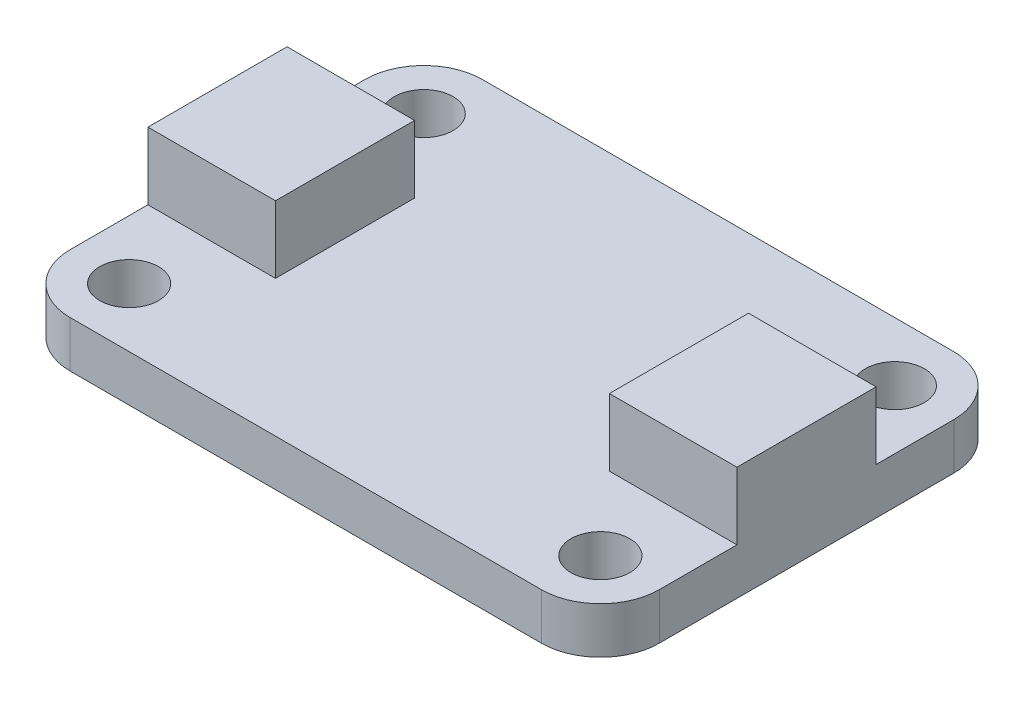
ISO-10303-21;
HEADER;
FILE_DESCRIPTION(('STEP AP214'),'2;1');
FILE_NAME('part.step','',(''),(''),'','','');
FILE_SCHEMA(('AUTOMOTIVE_DESIGN { 1 0 10303 214 1 1 1 1 }'));
ENDSEC;
DATA;
#1=APPLICATION_CONTEXT('core data for automotive mechanical design processes');
#2=APPLICATION_PROTOCOL_DEFINITION('international standard','automotive_design',2000,#1);
#3=PRODUCT_CONTEXT('',#1,'mechanical');
#4=PRODUCT('Part','Part','',(#3));
#5=PRODUCT_RELATED_PRODUCT_CATEGORY('part','',(#4));
#6=PRODUCT_DEFINITION_FORMATION('','',#4);
#7=PRODUCT_DEFINITION_CONTEXT('part definition',#1,'design');
#8=PRODUCT_DEFINITION('design','',#6,#7);
#9=PRODUCT_DEFINITION_SHAPE('','',#8);
#10=(LENGTH_UNIT() NAMED_UNIT(*) SI_UNIT(.MILLI.,.METRE.));
#11=(NAMED_UNIT(*) PLANE_ANGLE_UNIT() SI_UNIT($,.RADIAN.));
#12=(NAMED_UNIT(*) SI_UNIT($,.STERADIAN.) SOLID_ANGLE_UNIT());
#13=UNCERTAINTY_MEASURE_WITH_UNIT(LENGTH_MEASURE(1.E-05),#10,'distance_accuracy_value','');
#14=(GEOMETRIC_REPRESENTATION_CONTEXT(3) GLOBAL_UNCERTAINTY_ASSIGNED_CONTEXT((#13)) GLOBAL_UNIT_ASSIGNED_CONTEXT((#10,
#11,#12)) REPRESENTATION_CONTEXT('',''));
#15=CARTESIAN_POINT('',(0.,0.,0.));
#16=DIRECTION('',(0.,0.,1.));
#17=DIRECTION('',(1.,0.,0.));
#18=AXIS2_PLACEMENT_3D('',#15,#16,#17);
#19=CARTESIAN_POINT('',(0.,2.,0.));
#20=DIRECTION('',(0.,-1.,0.));
#21=DIRECTION('',(0.,0.,-1.));
#22=AXIS2_PLACEMENT_3D('',#19,#20,#21);
#23=PLANE('',#22);
#24=CARTESIAN_POINT('',(2.54,2.,-2.54));
#25=DIRECTION('',(0.,1.,0.));
#26=DIRECTION('',(0.,0.,-1.));
#27=AXIS2_PLACEMENT_3D('',#24,#25,#26);
#28=CIRCLE('',#27,1.27);
#29=CARTESIAN_POINT('',(2.54,2.,-3.81000000000001));
#30=VERTEX_POINT('',#29);
#31=EDGE_CURVE('E231',#30,#30,#28,.T.);
#32=ORIENTED_EDGE('',*,*,#31,.F.);
#33=EDGE_LOOP('',(#32));
#34=FACE_BOUND('',#33,.T.);
#35=CARTESIAN_POINT('',(22.86,2.,-2.54));
#36=DIRECTION('',(0.,1.,0.));
#37=DIRECTION('',(0.,0.,1.));
#38=AXIS2_PLACEMENT_3D('',#35,#36,#37);
#39=CIRCLE('',#38,1.27);
#40=CARTESIAN_POINT('',(22.86,2.,-1.27));
#41=VERTEX_POINT('',#40);
#42=EDGE_CURVE('E245',#41,#41,#39,.T.);
#43=ORIENTED_EDGE('',*,*,#42,.F.);
#44=EDGE_LOOP('',(#43));
#45=FACE_BOUND('',#44,.T.);
#46=CARTESIAN_POINT('',(22.86,2.,-15.24));
#47=DIRECTION('',(0.,1.,0.));
#48=DIRECTION('',(0.,0.,-1.));
#49=AXIS2_PLACEMENT_3D('',#46,#47,#48);
#50=CIRCLE('',#49,1.27);
#51=CARTESIAN_POINT('',(22.86,2.,-16.51));
#52=VERTEX_POINT('',#51);
#53=EDGE_CURVE('E237',#52,#52,#50,.T.);
#54=ORIENTED_EDGE('',*,*,#53,.F.);
#55=EDGE_LOOP('',(#54));
#56=FACE_BOUND('',#55,.T.);
#57=CARTESIAN_POINT('',(2.54,2.,-15.24));
#58=DIRECTION('',(0.,1.,0.));
#59=DIRECTION('',(0.,0.,1.));
#60=AXIS2_PLACEMENT_3D('',#57,#58,#59);
#61=CIRCLE('',#60,1.27);
#62=CARTESIAN_POINT('',(2.54,2.,-13.97));
#63=VERTEX_POINT('',#62);
#64=EDGE_CURVE('E236',#63,#63,#61,.T.);
#65=ORIENTED_EDGE('',*,*,#64,.F.);
#66=EDGE_LOOP('',(#65));
#67=FACE_BOUND('',#66,.T.);
#68=DIRECTION('',(0.,0.,-1.));
#69=VECTOR('',#68,1.);
#70=CARTESIAN_POINT('',(25.4,2.,0.));
#71=LINE('',#70,#69);
#72=CARTESIAN_POINT('',(25.4,2.,-11.89));
#73=VERTEX_POINT('',#72);
#74=CARTESIAN_POINT('',(25.4,2.,-15.24));
#75=VERTEX_POINT('',#74);
#76=EDGE_CURVE('E181',#73,#75,#71,.T.);
#77=ORIENTED_EDGE('',*,*,#76,.T.);
#78=CARTESIAN_POINT('',(22.86,2.,-15.24));
#79=DIRECTION('',(0.,-1.,0.));
#80=DIRECTION('',(0.,0.,-1.));
#81=AXIS2_PLACEMENT_3D('',#78,#79,#80);
#82=CIRCLE('',#81,2.54);
#83=CARTESIAN_POINT('',(22.86,2.,-17.78));
#84=VERTEX_POINT('',#83);
#85=EDGE_CURVE('E325',#75,#84,#82,.F.);
#86=ORIENTED_EDGE('',*,*,#85,.T.);
#87=DIRECTION('',(-1.,0.,0.));
#88=VECTOR('',#87,1.);
#89=CARTESIAN_POINT('',(0.,2.,-17.78));
#90=LINE('',#89,#88);
#91=CARTESIAN_POINT('',(2.54,2.,-17.78));
#92=VERTEX_POINT('',#91);
#93=EDGE_CURVE('E274',#84,#92,#90,.T.);
#94=ORIENTED_EDGE('',*,*,#93,.T.);
#95=CARTESIAN_POINT('',(2.54,2.,-15.24));
#96=DIRECTION('',(0.,-1.,0.));
#97=DIRECTION('',(0.,0.,-1.));
#98=AXIS2_PLACEMENT_3D('',#95,#96,#97);
#99=CIRCLE('',#98,2.54);
#100=CARTESIAN_POINT('',(0.,2.,-15.24));
#101=VERTEX_POINT('',#100);
#102=EDGE_CURVE('E317',#92,#101,#99,.F.);
#103=ORIENTED_EDGE('',*,*,#102,.T.);
#104=DIRECTION('',(0.,0.,1.));
#105=VECTOR('',#104,1.);
#106=CARTESIAN_POINT('',(0.,2.,0.));
#107=LINE('',#106,#105);
#108=CARTESIAN_POINT('',(0.,2.,-11.89));
#109=VERTEX_POINT('',#108);
#110=EDGE_CURVE('E264',#101,#109,#107,.T.);
#111=ORIENTED_EDGE('',*,*,#110,.T.);
#112=DIRECTION('',(-1.,0.,0.));
#113=VECTOR('',#112,1.);
#114=CARTESIAN_POINT('',(0.,2.,-11.89));
#115=LINE('',#114,#113);
#116=CARTESIAN_POINT('',(5.5,2.,-11.89));
#117=VERTEX_POINT('',#116);
#118=EDGE_CURVE('E200',#117,#109,#115,.T.);
#119=ORIENTED_EDGE('',*,*,#118,.F.);
#120=DIRECTION('',(0.,0.,-1.));
#121=VECTOR('',#120,1.);
#122=CARTESIAN_POINT('',(5.5,2.,-11.89));
#123=LINE('',#122,#121);
#124=CARTESIAN_POINT('',(5.5,2.,-5.89));
#125=VERTEX_POINT('',#124);
#126=EDGE_CURVE('E189',#125,#117,#123,.T.);
#127=ORIENTED_EDGE('',*,*,#126,.F.);
#128=DIRECTION('',(1.,0.,0.));
#129=VECTOR('',#128,1.);
#130=CARTESIAN_POINT('',(0.,2.,-5.89));
#131=LINE('',#130,#129);
#132=CARTESIAN_POINT('',(0.,2.,-5.89));
#133=VERTEX_POINT('',#132);
#134=EDGE_CURVE('E184',#133,#125,#131,.T.);
#135=ORIENTED_EDGE('',*,*,#134,.F.);
#136=CARTESIAN_POINT('',(0.,2.,-2.54));
#137=VERTEX_POINT('',#136);
#138=EDGE_CURVE('E268',#133,#137,#107,.T.);
#139=ORIENTED_EDGE('',*,*,#138,.T.);
#140=CARTESIAN_POINT('',(2.54,2.,-2.54));
#141=DIRECTION('',(0.,-1.,0.));
#142=DIRECTION('',(0.,0.,-1.));
#143=AXIS2_PLACEMENT_3D('',#140,#141,#142);
#144=CIRCLE('',#143,2.54);
#145=CARTESIAN_POINT('',(2.54,2.,0.));
#146=VERTEX_POINT('',#145);
#147=EDGE_CURVE('E62',#137,#146,#144,.F.);
#148=ORIENTED_EDGE('',*,*,#147,.T.);
#149=DIRECTION('',(1.,0.,0.));
#150=VECTOR('',#149,1.);
#151=CARTESIAN_POINT('',(0.,2.,0.));
#152=LINE('',#151,#150);
#153=CARTESIAN_POINT('',(22.86,2.,0.));
#154=VERTEX_POINT('',#153);
#155=EDGE_CURVE('E267',#146,#154,#152,.T.);
#156=ORIENTED_EDGE('',*,*,#155,.T.);
#157=CARTESIAN_POINT('',(22.86,2.,-2.54));
#158=DIRECTION('',(0.,-1.,0.));
#159=DIRECTION('',(0.,0.,-1.));
#160=AXIS2_PLACEMENT_3D('',#157,#158,#159);
#161=CIRCLE('',#160,2.54);
#162=CARTESIAN_POINT('',(25.4,2.,-2.54));
#163=VERTEX_POINT('',#162);
#164=EDGE_CURVE('E322',#154,#163,#161,.F.);
#165=ORIENTED_EDGE('',*,*,#164,.T.);
#166=CARTESIAN_POINT('',(25.4,2.,-5.89));
#167=VERTEX_POINT('',#166);
#168=EDGE_CURVE('E271',#163,#167,#71,.T.);
#169=ORIENTED_EDGE('',*,*,#168,.T.);
#170=DIRECTION('',(1.,0.,0.));
#171=VECTOR('',#170,1.);
#172=CARTESIAN_POINT('',(25.4,2.,-5.89));
#173=LINE('',#172,#171);
#174=CARTESIAN_POINT('',(19.9,2.,-5.89));
#175=VERTEX_POINT('',#174);
#176=EDGE_CURVE('E176',#175,#167,#173,.T.);
#177=ORIENTED_EDGE('',*,*,#176,.F.);
#178=DIRECTION('',(0.,0.,1.));
#179=VECTOR('',#178,1.);
#180=CARTESIAN_POINT('',(19.9,2.,-11.89));
#181=LINE('',#180,#179);
#182=CARTESIAN_POINT('',(19.9,2.,-11.89));
#183=VERTEX_POINT('',#182);
#184=EDGE_CURVE('E598',#183,#175,#181,.T.);
#185=ORIENTED_EDGE('',*,*,#184,.F.);
#186=DIRECTION('',(-1.,0.,0.));
#187=VECTOR('',#186,1.);
#188=CARTESIAN_POINT('',(25.4,2.,-11.89));
#189=LINE('',#188,#187);
#190=EDGE_CURVE('E596',#73,#183,#189,.T.);
#191=ORIENTED_EDGE('',*,*,#190,.F.);
#192=EDGE_LOOP('',(#77,#86,#94,#103,#111,#119,#127,#135,#139,#148,#156,#165,#169,#177,#185,#191));
#193=FACE_BOUND('',#192,.T.);
#194=ADVANCED_FACE('F39',(#34,#45,#56,#67,#193),#23,.F.);
#195=CARTESIAN_POINT('',(0.,2.,0.));
#196=DIRECTION('',(1.,0.,0.));
#197=DIRECTION('',(0.,0.,-1.));
#198=AXIS2_PLACEMENT_3D('',#195,#196,#197);
#199=PLANE('',#198);
#200=DIRECTION('',(0.,0.,1.));
#201=VECTOR('',#200,1.);
#202=CARTESIAN_POINT('',(0.,0.,0.));
#203=LINE('',#202,#201);
#204=CARTESIAN_POINT('',(0.,0.,-15.24));
#205=VERTEX_POINT('',#204);
#206=CARTESIAN_POINT('',(0.,0.,-2.54));
#207=VERTEX_POINT('',#206);
#208=EDGE_CURVE('E260',#205,#207,#203,.T.);
#209=ORIENTED_EDGE('',*,*,#208,.T.);
#210=DIRECTION('',(0.,-1.,0.));
#211=VECTOR('',#210,1.);
#212=CARTESIAN_POINT('',(0.,2.,-2.54));
#213=LINE('',#212,#211);
#214=EDGE_CURVE('E11',#207,#137,#213,.F.);
#215=ORIENTED_EDGE('',*,*,#214,.T.);
#216=ORIENTED_EDGE('',*,*,#138,.F.);
#217=DIRECTION('',(0.,-1.,0.));
#218=VECTOR('',#217,1.);
#219=CARTESIAN_POINT('',(0.,4.9,-5.89));
#220=LINE('',#219,#218);
#221=CARTESIAN_POINT('',(0.,4.9,-5.89));
#222=VERTEX_POINT('',#221);
#223=EDGE_CURVE('E227',#222,#133,#220,.T.);
#224=ORIENTED_EDGE('',*,*,#223,.F.);
#225=DIRECTION('',(0.,0.,1.));
#226=VECTOR('',#225,1.);
#227=CARTESIAN_POINT('',(0.,4.9,-11.89));
#228=LINE('',#227,#226);
#229=CARTESIAN_POINT('',(0.,4.9,-11.89));
#230=VERTEX_POINT('',#229);
#231=EDGE_CURVE('E195',#230,#222,#228,.T.);
#232=ORIENTED_EDGE('',*,*,#231,.F.);
#233=DIRECTION('',(0.,-1.,0.));
#234=VECTOR('',#233,1.);
#235=CARTESIAN_POINT('',(0.,4.9,-11.89));
#236=LINE('',#235,#234);
#237=EDGE_CURVE('E208',#230,#109,#236,.T.);
#238=ORIENTED_EDGE('',*,*,#237,.T.);
#239=ORIENTED_EDGE('',*,*,#110,.F.);
#240=DIRECTION('',(0.,-1.,0.));
#241=VECTOR('',#240,1.);
#242=CARTESIAN_POINT('',(0.,2.,-15.24));
#243=LINE('',#242,#241);
#244=EDGE_CURVE('E48',#101,#205,#243,.T.);
#245=ORIENTED_EDGE('',*,*,#244,.T.);
#246=EDGE_LOOP('',(#209,#215,#216,#224,#232,#238,#239,#245));
#247=FACE_BOUND('',#246,.T.);
#248=ADVANCED_FACE('F339',(#247),#199,.F.);
#249=CARTESIAN_POINT('',(0.,2.,0.));
#250=DIRECTION('',(0.,0.,-1.));
#251=DIRECTION('',(-1.,0.,0.));
#252=AXIS2_PLACEMENT_3D('',#249,#250,#251);
#253=PLANE('',#252);
#254=DIRECTION('',(1.,0.,0.));
#255=VECTOR('',#254,1.);
#256=CARTESIAN_POINT('',(0.,0.,0.));
#257=LINE('',#256,#255);
#258=CARTESIAN_POINT('',(2.54,0.,0.));
#259=VERTEX_POINT('',#258);
#260=CARTESIAN_POINT('',(22.86,0.,0.));
#261=VERTEX_POINT('',#260);
#262=EDGE_CURVE('E282',#259,#261,#257,.T.);
#263=ORIENTED_EDGE('',*,*,#262,.T.);
#264=DIRECTION('',(0.,-1.,0.));
#265=VECTOR('',#264,1.);
#266=CARTESIAN_POINT('',(22.86,2.,0.));
#267=LINE('',#266,#265);
#268=EDGE_CURVE('E55',#261,#154,#267,.F.);
#269=ORIENTED_EDGE('',*,*,#268,.T.);
#270=ORIENTED_EDGE('',*,*,#155,.F.);
#271=DIRECTION('',(0.,-1.,0.));
#272=VECTOR('',#271,1.);
#273=CARTESIAN_POINT('',(2.54,2.,0.));
#274=LINE('',#273,#272);
#275=EDGE_CURVE('E328',#146,#259,#274,.T.);
#276=ORIENTED_EDGE('',*,*,#275,.T.);
#277=EDGE_LOOP('',(#263,#269,#270,#276));
#278=FACE_BOUND('',#277,.T.);
#279=ADVANCED_FACE('F350',(#278),#253,.F.);
#280=CARTESIAN_POINT('',(25.4,2.,0.));
#281=DIRECTION('',(-1.,0.,0.));
#282=DIRECTION('',(0.,0.,1.));
#283=AXIS2_PLACEMENT_3D('',#280,#281,#282);
#284=PLANE('',#283);
#285=DIRECTION('',(0.,0.,-1.));
#286=VECTOR('',#285,1.);
#287=CARTESIAN_POINT('',(25.4,0.,0.));
#288=LINE('',#287,#286);
#289=CARTESIAN_POINT('',(25.4,0.,-2.54));
#290=VERTEX_POINT('',#289);
#291=CARTESIAN_POINT('',(25.4,0.,-15.24));
#292=VERTEX_POINT('',#291);
#293=EDGE_CURVE('E285',#290,#292,#288,.T.);
#294=ORIENTED_EDGE('',*,*,#293,.T.);
#295=DIRECTION('',(0.,-1.,0.));
#296=VECTOR('',#295,1.);
#297=CARTESIAN_POINT('',(25.4,2.,-15.24));
#298=LINE('',#297,#296);
#299=EDGE_CURVE('E314',#292,#75,#298,.F.);
#300=ORIENTED_EDGE('',*,*,#299,.T.);
#301=ORIENTED_EDGE('',*,*,#76,.F.);
#302=DIRECTION('',(0.,-1.,0.));
#303=VECTOR('',#302,1.);
#304=CARTESIAN_POINT('',(25.4,4.9,-11.89));
#305=LINE('',#304,#303);
#306=CARTESIAN_POINT('',(25.4,4.9,-11.89));
#307=VERTEX_POINT('',#306);
#308=EDGE_CURVE('E159',#307,#73,#305,.T.);
#309=ORIENTED_EDGE('',*,*,#308,.F.);
#310=DIRECTION('',(0.,0.,-1.));
#311=VECTOR('',#310,1.);
#312=CARTESIAN_POINT('',(25.4,4.9,-11.89));
#313=LINE('',#312,#311);
#314=CARTESIAN_POINT('',(25.4,4.9,-5.89));
#315=VERTEX_POINT('',#314);
#316=EDGE_CURVE('E166',#315,#307,#313,.T.);
#317=ORIENTED_EDGE('',*,*,#316,.F.);
#318=DIRECTION('',(0.,-1.,0.));
#319=VECTOR('',#318,1.);
#320=CARTESIAN_POINT('',(25.4,4.9,-5.89));
#321=LINE('',#320,#319);
#322=EDGE_CURVE('E609',#315,#167,#321,.T.);
#323=ORIENTED_EDGE('',*,*,#322,.T.);
#324=ORIENTED_EDGE('',*,*,#168,.F.);
#325=DIRECTION('',(0.,-1.,0.));
#326=VECTOR('',#325,1.);
#327=CARTESIAN_POINT('',(25.4,2.,-2.54));
#328=LINE('',#327,#326);
#329=EDGE_CURVE('E310',#163,#290,#328,.T.);
#330=ORIENTED_EDGE('',*,*,#329,.T.);
#331=EDGE_LOOP('',(#294,#300,#301,#309,#317,#323,#324,#330));
#332=FACE_BOUND('',#331,.T.);
#333=ADVANCED_FACE('F179',(#332),#284,.F.);
#334=CARTESIAN_POINT('',(0.,2.,-17.78));
#335=DIRECTION('',(0.,0.,1.));
#336=DIRECTION('',(1.,0.,0.));
#337=AXIS2_PLACEMENT_3D('',#334,#335,#336);
#338=PLANE('',#337);
#339=ORIENTED_EDGE('',*,*,#93,.F.);
#340=DIRECTION('',(0.,-1.,0.));
#341=VECTOR('',#340,1.);
#342=CARTESIAN_POINT('',(22.86,2.,-17.78));
#343=LINE('',#342,#341);
#344=CARTESIAN_POINT('',(22.86,0.,-17.78));
#345=VERTEX_POINT('',#344);
#346=EDGE_CURVE('E294',#84,#345,#343,.T.);
#347=ORIENTED_EDGE('',*,*,#346,.T.);
#348=DIRECTION('',(-1.,0.,0.));
#349=VECTOR('',#348,1.);
#350=CARTESIAN_POINT('',(0.,0.,-17.78));
#351=LINE('',#350,#349);
#352=CARTESIAN_POINT('',(2.54,0.,-17.78));
#353=VERTEX_POINT('',#352);
#354=EDGE_CURVE('E288',#345,#353,#351,.T.);
#355=ORIENTED_EDGE('',*,*,#354,.T.);
#356=DIRECTION('',(0.,-1.,0.));
#357=VECTOR('',#356,1.);
#358=CARTESIAN_POINT('',(2.54,2.,-17.78));
#359=LINE('',#358,#357);
#360=EDGE_CURVE('E278',#353,#92,#359,.F.);
#361=ORIENTED_EDGE('',*,*,#360,.T.);
#362=EDGE_LOOP('',(#339,#347,#355,#361));
#363=FACE_BOUND('',#362,.T.);
#364=ADVANCED_FACE('F364',(#363),#338,.F.);
#365=CARTESIAN_POINT('',(0.,0.,0.));
#366=DIRECTION('',(0.,-1.,0.));
#367=DIRECTION('',(0.,0.,-1.));
#368=AXIS2_PLACEMENT_3D('',#365,#366,#367);
#369=PLANE('',#368);
#370=CARTESIAN_POINT('',(2.54,0.,-2.54));
#371=DIRECTION('',(0.,1.,0.));
#372=DIRECTION('',(0.,0.,-1.));
#373=AXIS2_PLACEMENT_3D('',#370,#371,#372);
#374=CIRCLE('',#373,1.27);
#375=CARTESIAN_POINT('',(2.54,0.,-3.81000000000001));
#376=VERTEX_POINT('',#375);
#377=EDGE_CURVE('E249',#376,#376,#374,.T.);
#378=ORIENTED_EDGE('',*,*,#377,.T.);
#379=EDGE_LOOP('',(#378));
#380=FACE_BOUND('',#379,.T.);
#381=CARTESIAN_POINT('',(22.86,0.,-2.54));
#382=DIRECTION('',(0.,1.,0.));
#383=DIRECTION('',(0.,0.,1.));
#384=AXIS2_PLACEMENT_3D('',#381,#382,#383);
#385=CIRCLE('',#384,1.27);
#386=CARTESIAN_POINT('',(22.86,0.,-1.27));
#387=VERTEX_POINT('',#386);
#388=EDGE_CURVE('E241',#387,#387,#385,.T.);
#389=ORIENTED_EDGE('',*,*,#388,.T.);
#390=EDGE_LOOP('',(#389));
#391=FACE_BOUND('',#390,.T.);
#392=CARTESIAN_POINT('',(22.86,0.,-15.24));
#393=DIRECTION('',(0.,1.,0.));
#394=DIRECTION('',(0.,0.,-1.));
#395=AXIS2_PLACEMENT_3D('',#392,#393,#394);
#396=CIRCLE('',#395,1.27);
#397=CARTESIAN_POINT('',(22.86,0.,-16.51));
#398=VERTEX_POINT('',#397);
#399=EDGE_CURVE('E232',#398,#398,#396,.T.);
#400=ORIENTED_EDGE('',*,*,#399,.T.);
#401=EDGE_LOOP('',(#400));
#402=FACE_BOUND('',#401,.T.);
#403=CARTESIAN_POINT('',(2.54,0.,-15.24));
#404=DIRECTION('',(0.,1.,0.));
#405=DIRECTION('',(0.,0.,1.));
#406=AXIS2_PLACEMENT_3D('',#403,#404,#405);
#407=CIRCLE('',#406,1.27);
#408=CARTESIAN_POINT('',(2.54,0.,-13.97));
#409=VERTEX_POINT('',#408);
#410=EDGE_CURVE('E256',#409,#409,#407,.T.);
#411=ORIENTED_EDGE('',*,*,#410,.T.);
#412=EDGE_LOOP('',(#411));
#413=FACE_BOUND('',#412,.T.);
#414=ORIENTED_EDGE('',*,*,#354,.F.);
#415=CARTESIAN_POINT('',(22.86,0.,-15.24));
#416=DIRECTION('',(0.,-1.,0.));
#417=DIRECTION('',(0.,0.,-1.));
#418=AXIS2_PLACEMENT_3D('',#415,#416,#417);
#419=CIRCLE('',#418,2.54);
#420=EDGE_CURVE('E307',#345,#292,#419,.T.);
#421=ORIENTED_EDGE('',*,*,#420,.T.);
#422=ORIENTED_EDGE('',*,*,#293,.F.);
#423=CARTESIAN_POINT('',(22.86,0.,-2.54));
#424=DIRECTION('',(0.,-1.,0.));
#425=DIRECTION('',(0.,0.,-1.));
#426=AXIS2_PLACEMENT_3D('',#423,#424,#425);
#427=CIRCLE('',#426,2.54);
#428=EDGE_CURVE('E304',#290,#261,#427,.T.);
#429=ORIENTED_EDGE('',*,*,#428,.T.);
#430=ORIENTED_EDGE('',*,*,#262,.F.);
#431=CARTESIAN_POINT('',(2.54,0.,-2.54));
#432=DIRECTION('',(0.,-1.,0.));
#433=DIRECTION('',(0.,0.,-1.));
#434=AXIS2_PLACEMENT_3D('',#431,#432,#433);
#435=CIRCLE('',#434,2.54);
#436=EDGE_CURVE('E301',#259,#207,#435,.T.);
#437=ORIENTED_EDGE('',*,*,#436,.T.);
#438=ORIENTED_EDGE('',*,*,#208,.F.);
#439=CARTESIAN_POINT('',(2.54,0.,-15.24));
#440=DIRECTION('',(0.,-1.,0.));
#441=DIRECTION('',(0.,0.,-1.));
#442=AXIS2_PLACEMENT_3D('',#439,#440,#441);
#443=CIRCLE('',#442,2.54);
#444=EDGE_CURVE('E298',#205,#353,#443,.T.);
#445=ORIENTED_EDGE('',*,*,#444,.T.);
#446=EDGE_LOOP('',(#414,#421,#422,#429,#430,#437,#438,#445));
#447=FACE_BOUND('',#446,.T.);
#448=ADVANCED_FACE('F345',(#380,#391,#402,#413,#447),#369,.T.);
#449=CARTESIAN_POINT('',(2.54,0.,-15.24));
#450=DIRECTION('',(0.,1.,0.));
#451=DIRECTION('',(0.,0.,1.));
#452=AXIS2_PLACEMENT_3D('',#449,#450,#451);
#453=CYLINDRICAL_SURFACE('',#452,1.27);
#454=ORIENTED_EDGE('',*,*,#410,.F.);
#455=EDGE_LOOP('',(#454));
#456=FACE_BOUND('',#455,.T.);
#457=ORIENTED_EDGE('',*,*,#64,.T.);
#458=EDGE_LOOP('',(#457));
#459=FACE_BOUND('',#458,.T.);
#460=ADVANCED_FACE('F381',(#456,#459),#453,.F.);
#461=CARTESIAN_POINT('',(22.86,0.,-15.24));
#462=DIRECTION('',(0.,1.,0.));
#463=DIRECTION('',(0.,0.,1.));
#464=AXIS2_PLACEMENT_3D('',#461,#462,#463);
#465=CYLINDRICAL_SURFACE('',#464,1.27);
#466=ORIENTED_EDGE('',*,*,#399,.F.);
#467=EDGE_LOOP('',(#466));
#468=FACE_BOUND('',#467,.T.);
#469=ORIENTED_EDGE('',*,*,#53,.T.);
#470=EDGE_LOOP('',(#469));
#471=FACE_BOUND('',#470,.T.);
#472=ADVANCED_FACE('F525',(#468,#471),#465,.F.);
#473=CARTESIAN_POINT('',(22.86,0.,-2.54));
#474=DIRECTION('',(0.,1.,0.));
#475=DIRECTION('',(0.,0.,1.));
#476=AXIS2_PLACEMENT_3D('',#473,#474,#475);
#477=CYLINDRICAL_SURFACE('',#476,1.27);
#478=ORIENTED_EDGE('',*,*,#388,.F.);
#479=EDGE_LOOP('',(#478));
#480=FACE_BOUND('',#479,.T.);
#481=ORIENTED_EDGE('',*,*,#42,.T.);
#482=EDGE_LOOP('',(#481));
#483=FACE_BOUND('',#482,.T.);
#484=ADVANCED_FACE('F517',(#480,#483),#477,.F.);
#485=CARTESIAN_POINT('',(2.54,0.,-2.54));
#486=DIRECTION('',(0.,1.,0.));
#487=DIRECTION('',(0.,0.,1.));
#488=AXIS2_PLACEMENT_3D('',#485,#486,#487);
#489=CYLINDRICAL_SURFACE('',#488,1.27);
#490=ORIENTED_EDGE('',*,*,#377,.F.);
#491=EDGE_LOOP('',(#490));
#492=FACE_BOUND('',#491,.T.);
#493=ORIENTED_EDGE('',*,*,#31,.T.);
#494=EDGE_LOOP('',(#493));
#495=FACE_BOUND('',#494,.T.);
#496=ADVANCED_FACE('F484',(#492,#495),#489,.F.);
#497=CARTESIAN_POINT('',(0.,4.9,-5.89));
#498=DIRECTION('',(0.,0.,-1.));
#499=DIRECTION('',(-1.,0.,0.));
#500=AXIS2_PLACEMENT_3D('',#497,#498,#499);
#501=PLANE('',#500);
#502=ORIENTED_EDGE('',*,*,#134,.T.);
#503=DIRECTION('',(0.,-1.,0.));
#504=VECTOR('',#503,1.);
#505=CARTESIAN_POINT('',(5.5,4.9,-5.89));
#506=LINE('',#505,#504);
#507=CARTESIAN_POINT('',(5.5,4.9,-5.89));
#508=VERTEX_POINT('',#507);
#509=EDGE_CURVE('E223',#508,#125,#506,.T.);
#510=ORIENTED_EDGE('',*,*,#509,.F.);
#511=DIRECTION('',(1.,0.,0.));
#512=VECTOR('',#511,1.);
#513=CARTESIAN_POINT('',(0.,4.9,-5.89));
#514=LINE('',#513,#512);
#515=EDGE_CURVE('E199',#222,#508,#514,.T.);
#516=ORIENTED_EDGE('',*,*,#515,.F.);
#517=ORIENTED_EDGE('',*,*,#223,.T.);
#518=EDGE_LOOP('',(#502,#510,#516,#517));
#519=FACE_BOUND('',#518,.T.);
#520=ADVANCED_FACE('F475',(#519),#501,.F.);
#521=CARTESIAN_POINT('',(5.5,4.9,-11.89));
#522=DIRECTION('',(-1.,0.,0.));
#523=DIRECTION('',(0.,0.,1.));
#524=AXIS2_PLACEMENT_3D('',#521,#522,#523);
#525=PLANE('',#524);
#526=ORIENTED_EDGE('',*,*,#126,.T.);
#527=DIRECTION('',(0.,-1.,0.));
#528=VECTOR('',#527,1.);
#529=CARTESIAN_POINT('',(5.5,4.9,-11.89));
#530=LINE('',#529,#528);
#531=CARTESIAN_POINT('',(5.5,4.9,-11.89));
#532=VERTEX_POINT('',#531);
#533=EDGE_CURVE('E219',#532,#117,#530,.T.);
#534=ORIENTED_EDGE('',*,*,#533,.F.);
#535=DIRECTION('',(0.,0.,-1.));
#536=VECTOR('',#535,1.);
#537=CARTESIAN_POINT('',(5.5,4.9,-11.89));
#538=LINE('',#537,#536);
#539=EDGE_CURVE('E203',#508,#532,#538,.T.);
#540=ORIENTED_EDGE('',*,*,#539,.F.);
#541=ORIENTED_EDGE('',*,*,#509,.T.);
#542=EDGE_LOOP('',(#526,#534,#540,#541));
#543=FACE_BOUND('',#542,.T.);
#544=ADVANCED_FACE('F466',(#543),#525,.F.);
#545=CARTESIAN_POINT('',(0.,4.9,-11.89));
#546=DIRECTION('',(0.,0.,1.));
#547=DIRECTION('',(1.,0.,0.));
#548=AXIS2_PLACEMENT_3D('',#545,#546,#547);
#549=PLANE('',#548);
#550=ORIENTED_EDGE('',*,*,#118,.T.);
#551=ORIENTED_EDGE('',*,*,#237,.F.);
#552=DIRECTION('',(-1.,0.,0.));
#553=VECTOR('',#552,1.);
#554=CARTESIAN_POINT('',(0.,4.9,-11.89));
#555=LINE('',#554,#553);
#556=EDGE_CURVE('E206',#532,#230,#555,.T.);
#557=ORIENTED_EDGE('',*,*,#556,.F.);
#558=ORIENTED_EDGE('',*,*,#533,.T.);
#559=EDGE_LOOP('',(#550,#551,#557,#558));
#560=FACE_BOUND('',#559,.T.);
#561=ADVANCED_FACE('F457',(#560),#549,.F.);
#562=CARTESIAN_POINT('',(0.,4.9,0.));
#563=DIRECTION('',(0.,1.,0.));
#564=DIRECTION('',(0.,0.,1.));
#565=AXIS2_PLACEMENT_3D('',#562,#563,#564);
#566=PLANE('',#565);
#567=ORIENTED_EDGE('',*,*,#231,.T.);
#568=ORIENTED_EDGE('',*,*,#515,.T.);
#569=ORIENTED_EDGE('',*,*,#539,.T.);
#570=ORIENTED_EDGE('',*,*,#556,.T.);
#571=EDGE_LOOP('',(#567,#568,#569,#570));
#572=FACE_BOUND('',#571,.T.);
#573=ADVANCED_FACE('F449',(#572),#566,.T.);
#574=CARTESIAN_POINT('',(25.4,4.9,-11.89));
#575=DIRECTION('',(0.,0.,1.));
#576=DIRECTION('',(1.,0.,0.));
#577=AXIS2_PLACEMENT_3D('',#574,#575,#576);
#578=PLANE('',#577);
#579=ORIENTED_EDGE('',*,*,#190,.T.);
#580=DIRECTION('',(0.,-1.,0.));
#581=VECTOR('',#580,1.);
#582=CARTESIAN_POINT('',(19.9,4.9,-11.89));
#583=LINE('',#582,#581);
#584=CARTESIAN_POINT('',(19.9,4.9,-11.89));
#585=VERTEX_POINT('',#584);
#586=EDGE_CURVE('E161',#585,#183,#583,.T.);
#587=ORIENTED_EDGE('',*,*,#586,.F.);
#588=DIRECTION('',(-1.,0.,0.));
#589=VECTOR('',#588,1.);
#590=CARTESIAN_POINT('',(25.4,4.9,-11.89));
#591=LINE('',#590,#589);
#592=EDGE_CURVE('E154',#307,#585,#591,.T.);
#593=ORIENTED_EDGE('',*,*,#592,.F.);
#594=ORIENTED_EDGE('',*,*,#308,.T.);
#595=EDGE_LOOP('',(#579,#587,#593,#594));
#596=FACE_BOUND('',#595,.T.);
#597=ADVANCED_FACE('F157',(#596),#578,.F.);
#598=CARTESIAN_POINT('',(19.9,4.9,-11.89));
#599=DIRECTION('',(1.,0.,0.));
#600=DIRECTION('',(0.,0.,-1.));
#601=AXIS2_PLACEMENT_3D('',#598,#599,#600);
#602=PLANE('',#601);
#603=ORIENTED_EDGE('',*,*,#184,.T.);
#604=DIRECTION('',(0.,-1.,0.));
#605=VECTOR('',#604,1.);
#606=CARTESIAN_POINT('',(19.9,4.9,-5.89));
#607=LINE('',#606,#605);
#608=CARTESIAN_POINT('',(19.9,4.9,-5.89));
#609=VERTEX_POINT('',#608);
#610=EDGE_CURVE('E191',#609,#175,#607,.T.);
#611=ORIENTED_EDGE('',*,*,#610,.F.);
#612=DIRECTION('',(0.,0.,1.));
#613=VECTOR('',#612,1.);
#614=CARTESIAN_POINT('',(19.9,4.9,-11.89));
#615=LINE('',#614,#613);
#616=EDGE_CURVE('E165',#585,#609,#615,.T.);
#617=ORIENTED_EDGE('',*,*,#616,.F.);
#618=ORIENTED_EDGE('',*,*,#586,.T.);
#619=EDGE_LOOP('',(#603,#611,#617,#618));
#620=FACE_BOUND('',#619,.T.);
#621=ADVANCED_FACE('F432',(#620),#602,.F.);
#622=CARTESIAN_POINT('',(25.4,4.9,-5.89));
#623=DIRECTION('',(0.,0.,-1.));
#624=DIRECTION('',(-1.,0.,0.));
#625=AXIS2_PLACEMENT_3D('',#622,#623,#624);
#626=PLANE('',#625);
#627=ORIENTED_EDGE('',*,*,#176,.T.);
#628=ORIENTED_EDGE('',*,*,#322,.F.);
#629=DIRECTION('',(1.,0.,0.));
#630=VECTOR('',#629,1.);
#631=CARTESIAN_POINT('',(25.4,4.9,-5.89));
#632=LINE('',#631,#630);
#633=EDGE_CURVE('E171',#609,#315,#632,.T.);
#634=ORIENTED_EDGE('',*,*,#633,.F.);
#635=ORIENTED_EDGE('',*,*,#610,.T.);
#636=EDGE_LOOP('',(#627,#628,#634,#635));
#637=FACE_BOUND('',#636,.T.);
#638=ADVANCED_FACE('F424',(#637),#626,.F.);
#639=CARTESIAN_POINT('',(0.,4.9,0.));
#640=DIRECTION('',(0.,-1.,0.));
#641=DIRECTION('',(0.,0.,-1.));
#642=AXIS2_PLACEMENT_3D('',#639,#640,#641);
#643=PLANE('',#642);
#644=ORIENTED_EDGE('',*,*,#316,.T.);
#645=ORIENTED_EDGE('',*,*,#592,.T.);
#646=ORIENTED_EDGE('',*,*,#616,.T.);
#647=ORIENTED_EDGE('',*,*,#633,.T.);
#648=EDGE_LOOP('',(#644,#645,#646,#647));
#649=FACE_BOUND('',#648,.T.);
#650=ADVANCED_FACE('F169',(#649),#643,.F.);
#651=CARTESIAN_POINT('',(22.86,2.,-15.24));
#652=DIRECTION('',(0.,-1.,0.));
#653=DIRECTION('',(0.,0.,-1.));
#654=AXIS2_PLACEMENT_3D('',#651,#652,#653);
#655=CYLINDRICAL_SURFACE('',#654,2.54);
#656=ORIENTED_EDGE('',*,*,#85,.F.);
#657=ORIENTED_EDGE('',*,*,#299,.F.);
#658=ORIENTED_EDGE('',*,*,#420,.F.);
#659=ORIENTED_EDGE('',*,*,#346,.F.);
#660=EDGE_LOOP('',(#656,#657,#658,#659));
#661=FACE_BOUND('',#660,.T.);
#662=ADVANCED_FACE('F361',(#661),#655,.T.);
#663=CARTESIAN_POINT('',(22.86,2.,-2.54));
#664=DIRECTION('',(0.,-1.,0.));
#665=DIRECTION('',(0.,0.,-1.));
#666=AXIS2_PLACEMENT_3D('',#663,#664,#665);
#667=CYLINDRICAL_SURFACE('',#666,2.54);
#668=ORIENTED_EDGE('',*,*,#164,.F.);
#669=ORIENTED_EDGE('',*,*,#268,.F.);
#670=ORIENTED_EDGE('',*,*,#428,.F.);
#671=ORIENTED_EDGE('',*,*,#329,.F.);
#672=EDGE_LOOP('',(#668,#669,#670,#671));
#673=FACE_BOUND('',#672,.T.);
#674=ADVANCED_FACE('F355',(#673),#667,.T.);
#675=CARTESIAN_POINT('',(2.54,2.,-2.54));
#676=DIRECTION('',(0.,-1.,0.));
#677=DIRECTION('',(0.,0.,-1.));
#678=AXIS2_PLACEMENT_3D('',#675,#676,#677);
#679=CYLINDRICAL_SURFACE('',#678,2.54);
#680=ORIENTED_EDGE('',*,*,#147,.F.);
#681=ORIENTED_EDGE('',*,*,#214,.F.);
#682=ORIENTED_EDGE('',*,*,#436,.F.);
#683=ORIENTED_EDGE('',*,*,#275,.F.);
#684=EDGE_LOOP('',(#680,#681,#682,#683));
#685=FACE_BOUND('',#684,.T.);
#686=ADVANCED_FACE('F349',(#685),#679,.T.);
#687=CARTESIAN_POINT('',(2.54,2.,-15.24));
#688=DIRECTION('',(0.,-1.,0.));
#689=DIRECTION('',(0.,0.,-1.));
#690=AXIS2_PLACEMENT_3D('',#687,#688,#689);
#691=CYLINDRICAL_SURFACE('',#690,2.54);
#692=ORIENTED_EDGE('',*,*,#102,.F.);
#693=ORIENTED_EDGE('',*,*,#360,.F.);
#694=ORIENTED_EDGE('',*,*,#444,.F.);
#695=ORIENTED_EDGE('',*,*,#244,.F.);
#696=EDGE_LOOP('',(#692,#693,#694,#695));
#697=FACE_BOUND('',#696,.T.);
#698=ADVANCED_FACE('F41',(#697),#691,.T.);
#699=CLOSED_SHELL('',(#194,#248,#279,#333,#364,#448,#460,#472,#484,#496,#520,#544,#561,#573,
#597,#621,#638,#650,#662,#674,#686,#698));
#700=MANIFOLD_SOLID_BREP('B2',#699);
#701=ADVANCED_BREP_SHAPE_REPRESENTATION('',(#18,#700),#14);
#702=SHAPE_DEFINITION_REPRESENTATION(#9,#701);
ENDSEC;
END-ISO-10303-21;
